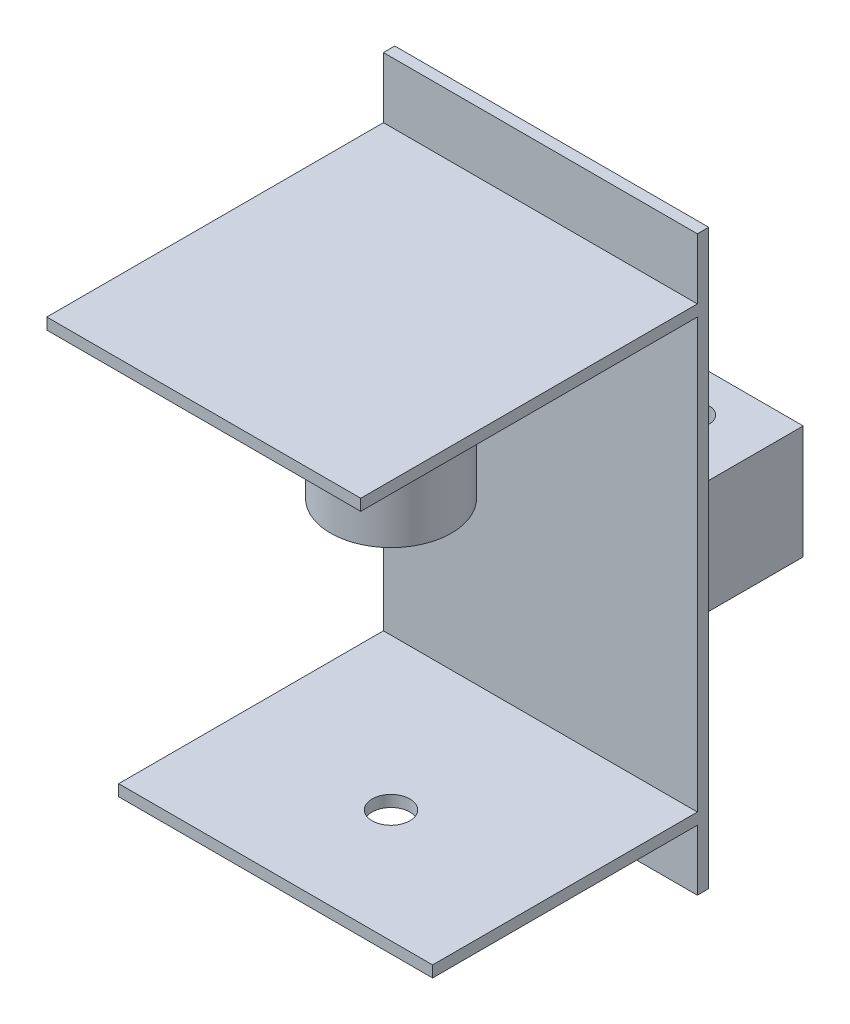
ISO-10303-21;
HEADER;
FILE_DESCRIPTION(('STEP AP214'),'2;1');
FILE_NAME('part.step','',(''),(''),'','','');
FILE_SCHEMA(('AUTOMOTIVE_DESIGN { 1 0 10303 214 1 1 1 1 }'));
ENDSEC;
DATA;
#1=APPLICATION_CONTEXT('core data for automotive mechanical design processes');
#2=APPLICATION_PROTOCOL_DEFINITION('international standard','automotive_design',2000,#1);
#3=PRODUCT_CONTEXT('',#1,'mechanical');
#4=PRODUCT('Part','Part','',(#3));
#5=PRODUCT_RELATED_PRODUCT_CATEGORY('part','',(#4));
#6=PRODUCT_DEFINITION_FORMATION('','',#4);
#7=PRODUCT_DEFINITION_CONTEXT('part definition',#1,'design');
#8=PRODUCT_DEFINITION('design','',#6,#7);
#9=PRODUCT_DEFINITION_SHAPE('','',#8);
#10=(LENGTH_UNIT() NAMED_UNIT(*) SI_UNIT(.MILLI.,.METRE.));
#11=(NAMED_UNIT(*) PLANE_ANGLE_UNIT() SI_UNIT($,.RADIAN.));
#12=(NAMED_UNIT(*) SI_UNIT($,.STERADIAN.) SOLID_ANGLE_UNIT());
#13=UNCERTAINTY_MEASURE_WITH_UNIT(LENGTH_MEASURE(1.E-05),#10,'distance_accuracy_value','');
#14=(GEOMETRIC_REPRESENTATION_CONTEXT(3) GLOBAL_UNCERTAINTY_ASSIGNED_CONTEXT((#13)) GLOBAL_UNIT_ASSIGNED_CONTEXT((#10,
#11,#12)) REPRESENTATION_CONTEXT('',''));
#15=CARTESIAN_POINT('',(0.,0.,0.));
#16=DIRECTION('',(0.,0.,1.));
#17=DIRECTION('',(1.,0.,0.));
#18=AXIS2_PLACEMENT_3D('',#15,#16,#17);
#19=CARTESIAN_POINT('',(0.,0.,0.));
#20=DIRECTION('',(0.,0.,-1.));
#21=DIRECTION('',(-1.,0.,0.));
#22=AXIS2_PLACEMENT_3D('',#19,#20,#21);
#23=PLANE('',#22);
#24=DIRECTION('',(1.,0.,0.));
#25=VECTOR('',#24,1.);
#26=CARTESIAN_POINT('',(4.979,88.45,0.));
#27=LINE('',#26,#25);
#28=CARTESIAN_POINT('',(4.979,88.45,0.));
#29=VERTEX_POINT('',#28);
#30=CARTESIAN_POINT('',(38.979,88.45,0.));
#31=VERTEX_POINT('',#30);
#32=EDGE_CURVE('E260',#29,#31,#27,.T.);
#33=ORIENTED_EDGE('',*,*,#32,.F.);
#34=DIRECTION('',(0.,1.,0.));
#35=VECTOR('',#34,1.);
#36=CARTESIAN_POINT('',(4.979,58.45,0.));
#37=LINE('',#36,#35);
#38=CARTESIAN_POINT('',(4.979,58.45,0.));
#39=VERTEX_POINT('',#38);
#40=EDGE_CURVE('E256',#39,#29,#37,.T.);
#41=ORIENTED_EDGE('',*,*,#40,.F.);
#42=DIRECTION('',(1.,0.,0.));
#43=VECTOR('',#42,1.);
#44=CARTESIAN_POINT('',(4.979,58.45,0.));
#45=LINE('',#44,#43);
#46=CARTESIAN_POINT('',(38.979,58.45,0.));
#47=VERTEX_POINT('',#46);
#48=EDGE_CURVE('E243',#39,#47,#45,.T.);
#49=ORIENTED_EDGE('',*,*,#48,.T.);
#50=DIRECTION('',(0.,1.,0.));
#51=VECTOR('',#50,1.);
#52=CARTESIAN_POINT('',(38.979,58.45,0.));
#53=LINE('',#52,#51);
#54=EDGE_CURVE('E277',#47,#31,#53,.T.);
#55=ORIENTED_EDGE('',*,*,#54,.T.);
#56=EDGE_LOOP('',(#33,#41,#49,#55));
#57=FACE_BOUND('',#56,.T.);
#58=DIRECTION('',(0.,-1.,0.));
#59=VECTOR('',#58,1.);
#60=CARTESIAN_POINT('',(0.,0.,0.));
#61=LINE('',#60,#59);
#62=CARTESIAN_POINT('',(0.,151.45,0.));
#63=VERTEX_POINT('',#62);
#64=CARTESIAN_POINT('',(0.,0.,0.));
#65=VERTEX_POINT('',#64);
#66=EDGE_CURVE('E354',#63,#65,#61,.T.);
#67=ORIENTED_EDGE('',*,*,#66,.F.);
#68=DIRECTION('',(-1.,0.,0.));
#69=VECTOR('',#68,1.);
#70=CARTESIAN_POINT('',(0.,151.45,0.));
#71=LINE('',#70,#69);
#72=CARTESIAN_POINT('',(83.,151.45,0.));
#73=VERTEX_POINT('',#72);
#74=EDGE_CURVE('E384',#73,#63,#71,.T.);
#75=ORIENTED_EDGE('',*,*,#74,.F.);
#76=DIRECTION('',(0.,1.,0.));
#77=VECTOR('',#76,1.);
#78=CARTESIAN_POINT('',(83.,0.,0.));
#79=LINE('',#78,#77);
#80=CARTESIAN_POINT('',(83.,0.,0.));
#81=VERTEX_POINT('',#80);
#82=EDGE_CURVE('E381',#81,#73,#79,.T.);
#83=ORIENTED_EDGE('',*,*,#82,.F.);
#84=DIRECTION('',(1.,0.,0.));
#85=VECTOR('',#84,1.);
#86=CARTESIAN_POINT('',(0.,0.,0.));
#87=LINE('',#86,#85);
#88=EDGE_CURVE('E378',#65,#81,#87,.T.);
#89=ORIENTED_EDGE('',*,*,#88,.F.);
#90=EDGE_LOOP('',(#67,#75,#83,#89));
#91=FACE_BOUND('',#90,.T.);
#92=DIRECTION('',(0.,1.,0.));
#93=VECTOR('',#92,1.);
#94=CARTESIAN_POINT('',(43.98,58.45,0.));
#95=LINE('',#94,#93);
#96=CARTESIAN_POINT('',(43.98,58.45,0.));
#97=VERTEX_POINT('',#96);
#98=CARTESIAN_POINT('',(43.98,88.45,0.));
#99=VERTEX_POINT('',#98);
#100=EDGE_CURVE('E62',#97,#99,#95,.T.);
#101=ORIENTED_EDGE('',*,*,#100,.F.);
#102=DIRECTION('',(1.,0.,0.));
#103=VECTOR('',#102,1.);
#104=CARTESIAN_POINT('',(43.98,58.45,0.));
#105=LINE('',#104,#103);
#106=CARTESIAN_POINT('',(77.98,58.45,0.));
#107=VERTEX_POINT('',#106);
#108=EDGE_CURVE('E66',#97,#107,#105,.T.);
#109=ORIENTED_EDGE('',*,*,#108,.T.);
#110=DIRECTION('',(0.,1.,0.));
#111=VECTOR('',#110,1.);
#112=CARTESIAN_POINT('',(77.98,58.45,0.));
#113=LINE('',#112,#111);
#114=CARTESIAN_POINT('',(77.98,88.45,0.));
#115=VERTEX_POINT('',#114);
#116=EDGE_CURVE('E194',#107,#115,#113,.T.);
#117=ORIENTED_EDGE('',*,*,#116,.T.);
#118=DIRECTION('',(1.,0.,0.));
#119=VECTOR('',#118,1.);
#120=CARTESIAN_POINT('',(43.98,88.45,0.));
#121=LINE('',#120,#119);
#122=EDGE_CURVE('E216',#99,#115,#121,.T.);
#123=ORIENTED_EDGE('',*,*,#122,.F.);
#124=EDGE_LOOP('',(#101,#109,#117,#123));
#125=FACE_BOUND('',#124,.T.);
#126=ADVANCED_FACE('F45',(#57,#91,#125),#23,.T.);
#127=CARTESIAN_POINT('',(0.,0.,3.));
#128=DIRECTION('',(0.,0.,-1.));
#129=DIRECTION('',(-1.,0.,0.));
#130=AXIS2_PLACEMENT_3D('',#127,#128,#129);
#131=PLANE('',#130);
#132=DIRECTION('',(1.,0.,0.));
#133=VECTOR('',#132,1.);
#134=CARTESIAN_POINT('',(0.,135.4,3.));
#135=LINE('',#134,#133);
#136=CARTESIAN_POINT('',(0.,135.4,3.));
#137=VERTEX_POINT('',#136);
#138=CARTESIAN_POINT('',(83.,135.4,3.));
#139=VERTEX_POINT('',#138);
#140=EDGE_CURVE('E304',#137,#139,#135,.T.);
#141=ORIENTED_EDGE('',*,*,#140,.T.);
#142=DIRECTION('',(0.,1.,0.));
#143=VECTOR('',#142,1.);
#144=CARTESIAN_POINT('',(83.,0.,3.));
#145=LINE('',#144,#143);
#146=CARTESIAN_POINT('',(83.,151.45,3.));
#147=VERTEX_POINT('',#146);
#148=EDGE_CURVE('E365',#139,#147,#145,.T.);
#149=ORIENTED_EDGE('',*,*,#148,.T.);
#150=DIRECTION('',(-1.,0.,0.));
#151=VECTOR('',#150,1.);
#152=CARTESIAN_POINT('',(0.,151.45,3.));
#153=LINE('',#152,#151);
#154=CARTESIAN_POINT('',(0.,151.45,3.));
#155=VERTEX_POINT('',#154);
#156=EDGE_CURVE('E370',#147,#155,#153,.T.);
#157=ORIENTED_EDGE('',*,*,#156,.T.);
#158=DIRECTION('',(0.,-1.,0.));
#159=VECTOR('',#158,1.);
#160=CARTESIAN_POINT('',(0.,0.,3.));
#161=LINE('',#160,#159);
#162=EDGE_CURVE('E357',#155,#137,#161,.T.);
#163=ORIENTED_EDGE('',*,*,#162,.T.);
#164=EDGE_LOOP('',(#141,#149,#157,#163));
#165=FACE_BOUND('',#164,.T.);
#166=ADVANCED_FACE('F423',(#165),#131,.F.);
#167=DIRECTION('',(1.,0.,0.));
#168=VECTOR('',#167,1.);
#169=CARTESIAN_POINT('',(0.,16.05,3.));
#170=LINE('',#169,#168);
#171=CARTESIAN_POINT('',(0.,16.05,3.));
#172=VERTEX_POINT('',#171);
#173=CARTESIAN_POINT('',(83.,16.05,3.));
#174=VERTEX_POINT('',#173);
#175=EDGE_CURVE('E340',#172,#174,#170,.T.);
#176=ORIENTED_EDGE('',*,*,#175,.F.);
#177=CARTESIAN_POINT('',(0.,0.,3.));
#178=VERTEX_POINT('',#177);
#179=EDGE_CURVE('E362',#172,#178,#161,.T.);
#180=ORIENTED_EDGE('',*,*,#179,.T.);
#181=DIRECTION('',(1.,0.,0.));
#182=VECTOR('',#181,1.);
#183=CARTESIAN_POINT('',(0.,0.,3.));
#184=LINE('',#183,#182);
#185=CARTESIAN_POINT('',(83.,0.,3.));
#186=VERTEX_POINT('',#185);
#187=EDGE_CURVE('E360',#178,#186,#184,.T.);
#188=ORIENTED_EDGE('',*,*,#187,.T.);
#189=EDGE_CURVE('E366',#186,#174,#145,.T.);
#190=ORIENTED_EDGE('',*,*,#189,.T.);
#191=EDGE_LOOP('',(#176,#180,#188,#190));
#192=FACE_BOUND('',#191,.T.);
#193=ADVANCED_FACE('F446',(#192),#131,.F.);
#194=CARTESIAN_POINT('',(0.,0.,3.));
#195=DIRECTION('',(1.,0.,0.));
#196=DIRECTION('',(0.,0.,-1.));
#197=AXIS2_PLACEMENT_3D('',#194,#195,#196);
#198=PLANE('',#197);
#199=DIRECTION('',(0.,0.,-1.));
#200=VECTOR('',#199,1.);
#201=CARTESIAN_POINT('',(0.,135.4,3.));
#202=LINE('',#201,#200);
#203=CARTESIAN_POINT('',(0.,135.4,92.));
#204=VERTEX_POINT('',#203);
#205=EDGE_CURVE('E295',#204,#137,#202,.T.);
#206=ORIENTED_EDGE('',*,*,#205,.T.);
#207=ORIENTED_EDGE('',*,*,#162,.F.);
#208=DIRECTION('',(0.,0.,-1.));
#209=VECTOR('',#208,1.);
#210=CARTESIAN_POINT('',(0.,151.45,3.));
#211=LINE('',#210,#209);
#212=EDGE_CURVE('E374',#155,#63,#211,.T.);
#213=ORIENTED_EDGE('',*,*,#212,.T.);
#214=ORIENTED_EDGE('',*,*,#66,.T.);
#215=DIRECTION('',(0.,0.,-1.));
#216=VECTOR('',#215,1.);
#217=CARTESIAN_POINT('',(0.,0.,3.));
#218=LINE('',#217,#216);
#219=EDGE_CURVE('E55',#178,#65,#218,.T.);
#220=ORIENTED_EDGE('',*,*,#219,.F.);
#221=ORIENTED_EDGE('',*,*,#179,.F.);
#222=DIRECTION('',(0.,0.,-1.));
#223=VECTOR('',#222,1.);
#224=CARTESIAN_POINT('',(0.,16.05,3.));
#225=LINE('',#224,#223);
#226=CARTESIAN_POINT('',(0.,16.05,73.));
#227=VERTEX_POINT('',#226);
#228=EDGE_CURVE('E311',#227,#172,#225,.T.);
#229=ORIENTED_EDGE('',*,*,#228,.F.);
#230=DIRECTION('',(0.,-1.,0.));
#231=VECTOR('',#230,1.);
#232=CARTESIAN_POINT('',(0.,19.05,73.));
#233=LINE('',#232,#231);
#234=CARTESIAN_POINT('',(0.,19.05,73.));
#235=VERTEX_POINT('',#234);
#236=EDGE_CURVE('E351',#235,#227,#233,.T.);
#237=ORIENTED_EDGE('',*,*,#236,.F.);
#238=DIRECTION('',(0.,0.,-1.));
#239=VECTOR('',#238,1.);
#240=CARTESIAN_POINT('',(0.,19.05,3.));
#241=LINE('',#240,#239);
#242=CARTESIAN_POINT('',(0.,19.05,3.));
#243=VERTEX_POINT('',#242);
#244=EDGE_CURVE('E320',#235,#243,#241,.T.);
#245=ORIENTED_EDGE('',*,*,#244,.T.);
#246=CARTESIAN_POINT('',(0.,132.4,3.));
#247=VERTEX_POINT('',#246);
#248=EDGE_CURVE('E361',#247,#243,#161,.T.);
#249=ORIENTED_EDGE('',*,*,#248,.F.);
#250=DIRECTION('',(0.,0.,-1.));
#251=VECTOR('',#250,1.);
#252=CARTESIAN_POINT('',(0.,132.4,3.));
#253=LINE('',#252,#251);
#254=CARTESIAN_POINT('',(0.,132.4,92.));
#255=VERTEX_POINT('',#254);
#256=EDGE_CURVE('E299',#255,#247,#253,.T.);
#257=ORIENTED_EDGE('',*,*,#256,.F.);
#258=DIRECTION('',(0.,1.,0.));
#259=VECTOR('',#258,1.);
#260=CARTESIAN_POINT('',(0.,132.4,92.));
#261=LINE('',#260,#259);
#262=EDGE_CURVE('E291',#255,#204,#261,.T.);
#263=ORIENTED_EDGE('',*,*,#262,.T.);
#264=EDGE_LOOP('',(#206,#207,#213,#214,#220,#221,#229,#237,#245,#249,#257,#263));
#265=FACE_BOUND('',#264,.T.);
#266=ADVANCED_FACE('F47',(#265),#198,.F.);
#267=CARTESIAN_POINT('',(0.,0.,3.));
#268=DIRECTION('',(0.,1.,0.));
#269=DIRECTION('',(0.,0.,1.));
#270=AXIS2_PLACEMENT_3D('',#267,#268,#269);
#271=PLANE('',#270);
#272=ORIENTED_EDGE('',*,*,#88,.T.);
#273=DIRECTION('',(0.,0.,-1.));
#274=VECTOR('',#273,1.);
#275=CARTESIAN_POINT('',(83.,0.,3.));
#276=LINE('',#275,#274);
#277=EDGE_CURVE('E394',#186,#81,#276,.T.);
#278=ORIENTED_EDGE('',*,*,#277,.F.);
#279=ORIENTED_EDGE('',*,*,#187,.F.);
#280=ORIENTED_EDGE('',*,*,#219,.T.);
#281=EDGE_LOOP('',(#272,#278,#279,#280));
#282=FACE_BOUND('',#281,.T.);
#283=ADVANCED_FACE('F403',(#282),#271,.F.);
#284=CARTESIAN_POINT('',(83.,0.,3.));
#285=DIRECTION('',(-1.,0.,0.));
#286=DIRECTION('',(0.,0.,1.));
#287=AXIS2_PLACEMENT_3D('',#284,#285,#286);
#288=PLANE('',#287);
#289=DIRECTION('',(0.,0.,1.));
#290=VECTOR('',#289,1.);
#291=CARTESIAN_POINT('',(83.,132.4,3.));
#292=LINE('',#291,#290);
#293=CARTESIAN_POINT('',(83.,132.4,3.));
#294=VERTEX_POINT('',#293);
#295=CARTESIAN_POINT('',(83.,132.4,92.));
#296=VERTEX_POINT('',#295);
#297=EDGE_CURVE('E303',#294,#296,#292,.T.);
#298=ORIENTED_EDGE('',*,*,#297,.F.);
#299=CARTESIAN_POINT('',(83.,19.05,3.));
#300=VERTEX_POINT('',#299);
#301=EDGE_CURVE('E371',#300,#294,#145,.T.);
#302=ORIENTED_EDGE('',*,*,#301,.F.);
#303=DIRECTION('',(0.,0.,1.));
#304=VECTOR('',#303,1.);
#305=CARTESIAN_POINT('',(83.,19.05,3.));
#306=LINE('',#305,#304);
#307=CARTESIAN_POINT('',(83.,19.05,73.));
#308=VERTEX_POINT('',#307);
#309=EDGE_CURVE('E329',#300,#308,#306,.T.);
#310=ORIENTED_EDGE('',*,*,#309,.T.);
#311=DIRECTION('',(0.,-1.,0.));
#312=VECTOR('',#311,1.);
#313=CARTESIAN_POINT('',(83.,19.05,73.));
#314=LINE('',#313,#312);
#315=CARTESIAN_POINT('',(83.,16.05,73.));
#316=VERTEX_POINT('',#315);
#317=EDGE_CURVE('E337',#308,#316,#314,.T.);
#318=ORIENTED_EDGE('',*,*,#317,.T.);
#319=DIRECTION('',(0.,0.,1.));
#320=VECTOR('',#319,1.);
#321=CARTESIAN_POINT('',(83.,16.05,3.));
#322=LINE('',#321,#320);
#323=EDGE_CURVE('E344',#174,#316,#322,.T.);
#324=ORIENTED_EDGE('',*,*,#323,.F.);
#325=ORIENTED_EDGE('',*,*,#189,.F.);
#326=ORIENTED_EDGE('',*,*,#277,.T.);
#327=ORIENTED_EDGE('',*,*,#82,.T.);
#328=DIRECTION('',(0.,0.,-1.));
#329=VECTOR('',#328,1.);
#330=CARTESIAN_POINT('',(83.,151.45,3.));
#331=LINE('',#330,#329);
#332=EDGE_CURVE('E390',#147,#73,#331,.T.);
#333=ORIENTED_EDGE('',*,*,#332,.F.);
#334=ORIENTED_EDGE('',*,*,#148,.F.);
#335=DIRECTION('',(0.,0.,1.));
#336=VECTOR('',#335,1.);
#337=CARTESIAN_POINT('',(83.,135.4,3.));
#338=LINE('',#337,#336);
#339=CARTESIAN_POINT('',(83.,135.4,92.));
#340=VERTEX_POINT('',#339);
#341=EDGE_CURVE('E315',#139,#340,#338,.T.);
#342=ORIENTED_EDGE('',*,*,#341,.T.);
#343=DIRECTION('',(0.,1.,0.));
#344=VECTOR('',#343,1.);
#345=CARTESIAN_POINT('',(83.,132.4,92.));
#346=LINE('',#345,#344);
#347=EDGE_CURVE('E287',#296,#340,#346,.T.);
#348=ORIENTED_EDGE('',*,*,#347,.F.);
#349=EDGE_LOOP('',(#298,#302,#310,#318,#324,#325,#326,#327,#333,#334,#342,#348));
#350=FACE_BOUND('',#349,.T.);
#351=ADVANCED_FACE('F416',(#350),#288,.F.);
#352=CARTESIAN_POINT('',(0.,151.45,3.));
#353=DIRECTION('',(0.,-1.,0.));
#354=DIRECTION('',(0.,0.,-1.));
#355=AXIS2_PLACEMENT_3D('',#352,#353,#354);
#356=PLANE('',#355);
#357=ORIENTED_EDGE('',*,*,#74,.T.);
#358=ORIENTED_EDGE('',*,*,#212,.F.);
#359=ORIENTED_EDGE('',*,*,#156,.F.);
#360=ORIENTED_EDGE('',*,*,#332,.T.);
#361=EDGE_LOOP('',(#357,#358,#359,#360));
#362=FACE_BOUND('',#361,.T.);
#363=ADVANCED_FACE('F421',(#362),#356,.F.);
#364=ORIENTED_EDGE('',*,*,#301,.T.);
#365=DIRECTION('',(1.,0.,0.));
#366=VECTOR('',#365,1.);
#367=CARTESIAN_POINT('',(0.,132.4,3.));
#368=LINE('',#367,#366);
#369=EDGE_CURVE('E307',#247,#294,#368,.T.);
#370=ORIENTED_EDGE('',*,*,#369,.F.);
#371=ORIENTED_EDGE('',*,*,#248,.T.);
#372=DIRECTION('',(1.,0.,0.));
#373=VECTOR('',#372,1.);
#374=CARTESIAN_POINT('',(0.,19.05,3.));
#375=LINE('',#374,#373);
#376=EDGE_CURVE('E324',#243,#300,#375,.T.);
#377=ORIENTED_EDGE('',*,*,#376,.T.);
#378=EDGE_LOOP('',(#364,#370,#371,#377));
#379=FACE_BOUND('',#378,.T.);
#380=ADVANCED_FACE('F430',(#379),#131,.F.);
#381=CARTESIAN_POINT('',(0.,19.05,73.));
#382=DIRECTION('',(0.,0.,1.));
#383=DIRECTION('',(1.,0.,0.));
#384=AXIS2_PLACEMENT_3D('',#381,#382,#383);
#385=PLANE('',#384);
#386=DIRECTION('',(-1.,0.,0.));
#387=VECTOR('',#386,1.);
#388=CARTESIAN_POINT('',(0.,16.05,73.));
#389=LINE('',#388,#387);
#390=EDGE_CURVE('E325',#316,#227,#389,.T.);
#391=ORIENTED_EDGE('',*,*,#390,.F.);
#392=ORIENTED_EDGE('',*,*,#317,.F.);
#393=DIRECTION('',(-1.,0.,0.));
#394=VECTOR('',#393,1.);
#395=CARTESIAN_POINT('',(0.,19.05,73.));
#396=LINE('',#395,#394);
#397=EDGE_CURVE('E333',#308,#235,#396,.T.);
#398=ORIENTED_EDGE('',*,*,#397,.T.);
#399=ORIENTED_EDGE('',*,*,#236,.T.);
#400=EDGE_LOOP('',(#391,#392,#398,#399));
#401=FACE_BOUND('',#400,.T.);
#402=ADVANCED_FACE('F452',(#401),#385,.T.);
#403=CARTESIAN_POINT('',(0.,19.05,0.));
#404=DIRECTION('',(0.,1.,0.));
#405=DIRECTION('',(0.,0.,1.));
#406=AXIS2_PLACEMENT_3D('',#403,#404,#405);
#407=PLANE('',#406);
#408=CARTESIAN_POINT('',(42.,19.05,43.));
#409=DIRECTION('',(0.,1.,0.));
#410=DIRECTION('',(0.,0.,1.));
#411=AXIS2_PLACEMENT_3D('',#408,#409,#410);
#412=CIRCLE('',#411,5.);
#413=CARTESIAN_POINT('',(42.,19.05,48.));
#414=VERTEX_POINT('',#413);
#415=EDGE_CURVE('E746',#414,#414,#412,.T.);
#416=ORIENTED_EDGE('',*,*,#415,.F.);
#417=EDGE_LOOP('',(#416));
#418=FACE_BOUND('',#417,.T.);
#419=ORIENTED_EDGE('',*,*,#244,.F.);
#420=ORIENTED_EDGE('',*,*,#397,.F.);
#421=ORIENTED_EDGE('',*,*,#309,.F.);
#422=ORIENTED_EDGE('',*,*,#376,.F.);
#423=EDGE_LOOP('',(#419,#420,#421,#422));
#424=FACE_BOUND('',#423,.T.);
#425=ADVANCED_FACE('F455',(#418,#424),#407,.T.);
#426=CARTESIAN_POINT('',(0.,16.05,0.));
#427=DIRECTION('',(0.,1.,0.));
#428=DIRECTION('',(0.,0.,1.));
#429=AXIS2_PLACEMENT_3D('',#426,#427,#428);
#430=PLANE('',#429);
#431=CARTESIAN_POINT('',(42.,16.05,43.));
#432=DIRECTION('',(0.,1.,0.));
#433=DIRECTION('',(0.,0.,1.));
#434=AXIS2_PLACEMENT_3D('',#431,#432,#433);
#435=CIRCLE('',#434,5.);
#436=CARTESIAN_POINT('',(42.,16.05,48.));
#437=VERTEX_POINT('',#436);
#438=EDGE_CURVE('E49',#437,#437,#435,.T.);
#439=ORIENTED_EDGE('',*,*,#438,.T.);
#440=EDGE_LOOP('',(#439));
#441=FACE_BOUND('',#440,.T.);
#442=ORIENTED_EDGE('',*,*,#228,.T.);
#443=ORIENTED_EDGE('',*,*,#175,.T.);
#444=ORIENTED_EDGE('',*,*,#323,.T.);
#445=ORIENTED_EDGE('',*,*,#390,.T.);
#446=EDGE_LOOP('',(#442,#443,#444,#445));
#447=FACE_BOUND('',#446,.T.);
#448=ADVANCED_FACE('F450',(#441,#447),#430,.F.);
#449=CARTESIAN_POINT('',(0.,132.4,0.));
#450=DIRECTION('',(0.,-1.,0.));
#451=DIRECTION('',(0.,0.,1.));
#452=AXIS2_PLACEMENT_3D('',#449,#450,#451);
#453=PLANE('',#452);
#454=CARTESIAN_POINT('',(42.,132.4,43.));
#455=DIRECTION('',(0.,-1.,0.));
#456=DIRECTION('',(0.,0.,-1.));
#457=AXIS2_PLACEMENT_3D('',#454,#455,#456);
#458=CIRCLE('',#457,16.);
#459=CARTESIAN_POINT('',(42.,132.4,27.));
#460=VERTEX_POINT('',#459);
#461=EDGE_CURVE('E754',#460,#460,#458,.T.);
#462=ORIENTED_EDGE('',*,*,#461,.F.);
#463=EDGE_LOOP('',(#462));
#464=FACE_BOUND('',#463,.T.);
#465=ORIENTED_EDGE('',*,*,#256,.T.);
#466=ORIENTED_EDGE('',*,*,#369,.T.);
#467=ORIENTED_EDGE('',*,*,#297,.T.);
#468=DIRECTION('',(1.,0.,0.));
#469=VECTOR('',#468,1.);
#470=CARTESIAN_POINT('',(0.,132.4,92.));
#471=LINE('',#470,#469);
#472=EDGE_CURVE('E283',#255,#296,#471,.T.);
#473=ORIENTED_EDGE('',*,*,#472,.F.);
#474=EDGE_LOOP('',(#465,#466,#467,#473));
#475=FACE_BOUND('',#474,.T.);
#476=ADVANCED_FACE('F434',(#464,#475),#453,.T.);
#477=CARTESIAN_POINT('',(0.,135.4,0.));
#478=DIRECTION('',(0.,-1.,0.));
#479=DIRECTION('',(0.,0.,1.));
#480=AXIS2_PLACEMENT_3D('',#477,#478,#479);
#481=PLANE('',#480);
#482=ORIENTED_EDGE('',*,*,#205,.F.);
#483=DIRECTION('',(1.,0.,0.));
#484=VECTOR('',#483,1.);
#485=CARTESIAN_POINT('',(0.,135.4,92.));
#486=LINE('',#485,#484);
#487=EDGE_CURVE('E273',#204,#340,#486,.T.);
#488=ORIENTED_EDGE('',*,*,#487,.T.);
#489=ORIENTED_EDGE('',*,*,#341,.F.);
#490=ORIENTED_EDGE('',*,*,#140,.F.);
#491=EDGE_LOOP('',(#482,#488,#489,#490));
#492=FACE_BOUND('',#491,.T.);
#493=ADVANCED_FACE('F542',(#492),#481,.F.);
#494=CARTESIAN_POINT('',(0.,132.4,92.));
#495=DIRECTION('',(0.,0.,1.));
#496=DIRECTION('',(1.,0.,0.));
#497=AXIS2_PLACEMENT_3D('',#494,#495,#496);
#498=PLANE('',#497);
#499=ORIENTED_EDGE('',*,*,#487,.F.);
#500=ORIENTED_EDGE('',*,*,#262,.F.);
#501=ORIENTED_EDGE('',*,*,#472,.T.);
#502=ORIENTED_EDGE('',*,*,#347,.T.);
#503=EDGE_LOOP('',(#499,#500,#501,#502));
#504=FACE_BOUND('',#503,.T.);
#505=ADVANCED_FACE('F440',(#504),#498,.T.);
#506=CARTESIAN_POINT('',(4.979,58.45,-28.));
#507=DIRECTION('',(-1.,0.,0.));
#508=DIRECTION('',(0.,0.,1.));
#509=AXIS2_PLACEMENT_3D('',#506,#507,#508);
#510=PLANE('',#509);
#511=DIRECTION('',(0.,0.,1.));
#512=VECTOR('',#511,1.);
#513=CARTESIAN_POINT('',(4.979,88.45,-28.));
#514=LINE('',#513,#512);
#515=CARTESIAN_POINT('',(4.979,88.45,-28.));
#516=VERTEX_POINT('',#515);
#517=EDGE_CURVE('E235',#516,#29,#514,.T.);
#518=ORIENTED_EDGE('',*,*,#517,.F.);
#519=DIRECTION('',(0.,1.,0.));
#520=VECTOR('',#519,1.);
#521=CARTESIAN_POINT('',(4.979,58.45,-28.));
#522=LINE('',#521,#520);
#523=CARTESIAN_POINT('',(4.979,58.45,-28.));
#524=VERTEX_POINT('',#523);
#525=EDGE_CURVE('E270',#524,#516,#522,.T.);
#526=ORIENTED_EDGE('',*,*,#525,.F.);
#527=DIRECTION('',(0.,0.,1.));
#528=VECTOR('',#527,1.);
#529=CARTESIAN_POINT('',(4.979,58.45,-28.));
#530=LINE('',#529,#528);
#531=EDGE_CURVE('E239',#524,#39,#530,.T.);
#532=ORIENTED_EDGE('',*,*,#531,.T.);
#533=ORIENTED_EDGE('',*,*,#40,.T.);
#534=EDGE_LOOP('',(#518,#526,#532,#533));
#535=FACE_BOUND('',#534,.T.);
#536=ADVANCED_FACE('F564',(#535),#510,.T.);
#537=CARTESIAN_POINT('',(4.979,58.45,-28.));
#538=DIRECTION('',(0.,0.,-1.));
#539=DIRECTION('',(-1.,0.,0.));
#540=AXIS2_PLACEMENT_3D('',#537,#538,#539);
#541=PLANE('',#540);
#542=DIRECTION('',(-1.,0.,0.));
#543=VECTOR('',#542,1.);
#544=CARTESIAN_POINT('',(4.979,88.45,-28.));
#545=LINE('',#544,#543);
#546=CARTESIAN_POINT('',(38.979,88.45,-28.));
#547=VERTEX_POINT('',#546);
#548=EDGE_CURVE('E244',#547,#516,#545,.T.);
#549=ORIENTED_EDGE('',*,*,#548,.F.);
#550=DIRECTION('',(0.,1.,0.));
#551=VECTOR('',#550,1.);
#552=CARTESIAN_POINT('',(38.979,58.45,-28.));
#553=LINE('',#552,#551);
#554=CARTESIAN_POINT('',(38.979,58.45,-28.));
#555=VERTEX_POINT('',#554);
#556=EDGE_CURVE('E274',#555,#547,#553,.T.);
#557=ORIENTED_EDGE('',*,*,#556,.F.);
#558=DIRECTION('',(-1.,0.,0.));
#559=VECTOR('',#558,1.);
#560=CARTESIAN_POINT('',(4.979,58.45,-28.));
#561=LINE('',#560,#559);
#562=EDGE_CURVE('E252',#555,#524,#561,.T.);
#563=ORIENTED_EDGE('',*,*,#562,.T.);
#564=ORIENTED_EDGE('',*,*,#525,.T.);
#565=EDGE_LOOP('',(#549,#557,#563,#564));
#566=FACE_BOUND('',#565,.T.);
#567=ADVANCED_FACE('F576',(#566),#541,.T.);
#568=CARTESIAN_POINT('',(38.979,58.45,-28.));
#569=DIRECTION('',(1.,0.,0.));
#570=DIRECTION('',(0.,0.,-1.));
#571=AXIS2_PLACEMENT_3D('',#568,#569,#570);
#572=PLANE('',#571);
#573=DIRECTION('',(0.,0.,-1.));
#574=VECTOR('',#573,1.);
#575=CARTESIAN_POINT('',(38.979,88.45,-28.));
#576=LINE('',#575,#574);
#577=EDGE_CURVE('E263',#31,#547,#576,.T.);
#578=ORIENTED_EDGE('',*,*,#577,.F.);
#579=ORIENTED_EDGE('',*,*,#54,.F.);
#580=DIRECTION('',(0.,0.,-1.));
#581=VECTOR('',#580,1.);
#582=CARTESIAN_POINT('',(38.979,58.45,-28.));
#583=LINE('',#582,#581);
#584=EDGE_CURVE('E248',#47,#555,#583,.T.);
#585=ORIENTED_EDGE('',*,*,#584,.T.);
#586=ORIENTED_EDGE('',*,*,#556,.T.);
#587=EDGE_LOOP('',(#578,#579,#585,#586));
#588=FACE_BOUND('',#587,.T.);
#589=ADVANCED_FACE('F585',(#588),#572,.T.);
#590=CARTESIAN_POINT('',(0.,58.45,0.));
#591=DIRECTION('',(0.,1.,0.));
#592=DIRECTION('',(0.,0.,1.));
#593=AXIS2_PLACEMENT_3D('',#590,#591,#592);
#594=PLANE('',#593);
#595=CARTESIAN_POINT('',(21.979,58.45,-18.));
#596=DIRECTION('',(0.,1.,0.));
#597=DIRECTION('',(0.,0.,1.));
#598=AXIS2_PLACEMENT_3D('',#595,#596,#597);
#599=CIRCLE('',#598,4.15);
#600=CARTESIAN_POINT('',(21.979,58.45,-13.85));
#601=VERTEX_POINT('',#600);
#602=EDGE_CURVE('E231',#601,#601,#599,.T.);
#603=ORIENTED_EDGE('',*,*,#602,.T.);
#604=EDGE_LOOP('',(#603));
#605=FACE_BOUND('',#604,.T.);
#606=ORIENTED_EDGE('',*,*,#531,.F.);
#607=ORIENTED_EDGE('',*,*,#562,.F.);
#608=ORIENTED_EDGE('',*,*,#584,.F.);
#609=ORIENTED_EDGE('',*,*,#48,.F.);
#610=EDGE_LOOP('',(#606,#607,#608,#609));
#611=FACE_BOUND('',#610,.T.);
#612=ADVANCED_FACE('F594',(#605,#611),#594,.F.);
#613=CARTESIAN_POINT('',(0.,88.45,0.));
#614=DIRECTION('',(0.,1.,0.));
#615=DIRECTION('',(0.,0.,1.));
#616=AXIS2_PLACEMENT_3D('',#613,#614,#615);
#617=PLANE('',#616);
#618=CARTESIAN_POINT('',(21.979,88.45,-18.));
#619=DIRECTION('',(0.,1.,0.));
#620=DIRECTION('',(0.,0.,1.));
#621=AXIS2_PLACEMENT_3D('',#618,#619,#620);
#622=CIRCLE('',#621,4.15);
#623=CARTESIAN_POINT('',(21.979,88.45,-13.85));
#624=VERTEX_POINT('',#623);
#625=EDGE_CURVE('E227',#624,#624,#622,.T.);
#626=ORIENTED_EDGE('',*,*,#625,.F.);
#627=EDGE_LOOP('',(#626));
#628=FACE_BOUND('',#627,.T.);
#629=ORIENTED_EDGE('',*,*,#517,.T.);
#630=ORIENTED_EDGE('',*,*,#32,.T.);
#631=ORIENTED_EDGE('',*,*,#577,.T.);
#632=ORIENTED_EDGE('',*,*,#548,.T.);
#633=EDGE_LOOP('',(#629,#630,#631,#632));
#634=FACE_BOUND('',#633,.T.);
#635=ADVANCED_FACE('F603',(#628,#634),#617,.T.);
#636=CARTESIAN_POINT('',(21.979,58.45,-18.));
#637=DIRECTION('',(0.,1.,0.));
#638=DIRECTION('',(0.,0.,1.));
#639=AXIS2_PLACEMENT_3D('',#636,#637,#638);
#640=CYLINDRICAL_SURFACE('',#639,4.15);
#641=ORIENTED_EDGE('',*,*,#602,.F.);
#642=EDGE_LOOP('',(#641));
#643=FACE_BOUND('',#642,.T.);
#644=ORIENTED_EDGE('',*,*,#625,.T.);
#645=EDGE_LOOP('',(#644));
#646=FACE_BOUND('',#645,.T.);
#647=ADVANCED_FACE('F612',(#643,#646),#640,.F.);
#648=CARTESIAN_POINT('',(43.98,58.45,-30.));
#649=DIRECTION('',(-1.,0.,0.));
#650=DIRECTION('',(0.,0.,1.));
#651=AXIS2_PLACEMENT_3D('',#648,#649,#650);
#652=PLANE('',#651);
#653=DIRECTION('',(0.,0.,1.));
#654=VECTOR('',#653,1.);
#655=CARTESIAN_POINT('',(43.98,88.45,-30.));
#656=LINE('',#655,#654);
#657=CARTESIAN_POINT('',(43.98,88.45,-30.));
#658=VERTEX_POINT('',#657);
#659=EDGE_CURVE('E212',#658,#99,#656,.T.);
#660=ORIENTED_EDGE('',*,*,#659,.F.);
#661=DIRECTION('',(0.,1.,0.));
#662=VECTOR('',#661,1.);
#663=CARTESIAN_POINT('',(43.98,58.45,-30.));
#664=LINE('',#663,#662);
#665=CARTESIAN_POINT('',(43.98,58.45,-30.));
#666=VERTEX_POINT('',#665);
#667=EDGE_CURVE('E193',#666,#658,#664,.T.);
#668=ORIENTED_EDGE('',*,*,#667,.F.);
#669=DIRECTION('',(0.,0.,1.));
#670=VECTOR('',#669,1.);
#671=CARTESIAN_POINT('',(43.98,58.45,-30.));
#672=LINE('',#671,#670);
#673=EDGE_CURVE('E205',#666,#97,#672,.T.);
#674=ORIENTED_EDGE('',*,*,#673,.T.);
#675=ORIENTED_EDGE('',*,*,#100,.T.);
#676=EDGE_LOOP('',(#660,#668,#674,#675));
#677=FACE_BOUND('',#676,.T.);
#678=ADVANCED_FACE('F621',(#677),#652,.T.);
#679=CARTESIAN_POINT('',(43.98,58.45,-30.));
#680=DIRECTION('',(0.,0.,-1.));
#681=DIRECTION('',(-1.,0.,0.));
#682=AXIS2_PLACEMENT_3D('',#679,#680,#681);
#683=PLANE('',#682);
#684=DIRECTION('',(-1.,0.,0.));
#685=VECTOR('',#684,1.);
#686=CARTESIAN_POINT('',(43.98,88.45,-30.));
#687=LINE('',#686,#685);
#688=CARTESIAN_POINT('',(77.98,88.45,-30.));
#689=VERTEX_POINT('',#688);
#690=EDGE_CURVE('E188',#689,#658,#687,.T.);
#691=ORIENTED_EDGE('',*,*,#690,.F.);
#692=DIRECTION('',(0.,1.,0.));
#693=VECTOR('',#692,1.);
#694=CARTESIAN_POINT('',(77.98,58.45,-30.));
#695=LINE('',#694,#693);
#696=CARTESIAN_POINT('',(77.98,58.45,-30.));
#697=VERTEX_POINT('',#696);
#698=EDGE_CURVE('E182',#697,#689,#695,.T.);
#699=ORIENTED_EDGE('',*,*,#698,.F.);
#700=DIRECTION('',(-1.,0.,0.));
#701=VECTOR('',#700,1.);
#702=CARTESIAN_POINT('',(43.98,58.45,-30.));
#703=LINE('',#702,#701);
#704=EDGE_CURVE('E186',#697,#666,#703,.T.);
#705=ORIENTED_EDGE('',*,*,#704,.T.);
#706=ORIENTED_EDGE('',*,*,#667,.T.);
#707=EDGE_LOOP('',(#691,#699,#705,#706));
#708=FACE_BOUND('',#707,.T.);
#709=ADVANCED_FACE('F184',(#708),#683,.T.);
#710=CARTESIAN_POINT('',(77.98,58.45,-30.));
#711=DIRECTION('',(1.,0.,0.));
#712=DIRECTION('',(0.,0.,-1.));
#713=AXIS2_PLACEMENT_3D('',#710,#711,#712);
#714=PLANE('',#713);
#715=DIRECTION('',(0.,0.,-1.));
#716=VECTOR('',#715,1.);
#717=CARTESIAN_POINT('',(77.98,88.45,-30.));
#718=LINE('',#717,#716);
#719=EDGE_CURVE('E221',#115,#689,#718,.T.);
#720=ORIENTED_EDGE('',*,*,#719,.F.);
#721=ORIENTED_EDGE('',*,*,#116,.F.);
#722=DIRECTION('',(0.,0.,-1.));
#723=VECTOR('',#722,1.);
#724=CARTESIAN_POINT('',(77.98,58.45,-30.));
#725=LINE('',#724,#723);
#726=EDGE_CURVE('E197',#107,#697,#725,.T.);
#727=ORIENTED_EDGE('',*,*,#726,.T.);
#728=ORIENTED_EDGE('',*,*,#698,.T.);
#729=EDGE_LOOP('',(#720,#721,#727,#728));
#730=FACE_BOUND('',#729,.T.);
#731=ADVANCED_FACE('F198',(#730),#714,.T.);
#732=CARTESIAN_POINT('',(0.,58.45,0.));
#733=DIRECTION('',(0.,1.,0.));
#734=DIRECTION('',(0.,0.,1.));
#735=AXIS2_PLACEMENT_3D('',#732,#733,#734);
#736=PLANE('',#735);
#737=CARTESIAN_POINT('',(60.98,58.45,-18.));
#738=DIRECTION('',(0.,1.,0.));
#739=DIRECTION('',(0.,0.,1.));
#740=AXIS2_PLACEMENT_3D('',#737,#738,#739);
#741=CIRCLE('',#740,4.15);
#742=CARTESIAN_POINT('',(60.98,58.45,-13.85));
#743=VERTEX_POINT('',#742);
#744=EDGE_CURVE('E217',#743,#743,#741,.T.);
#745=ORIENTED_EDGE('',*,*,#744,.T.);
#746=EDGE_LOOP('',(#745));
#747=FACE_BOUND('',#746,.T.);
#748=ORIENTED_EDGE('',*,*,#673,.F.);
#749=ORIENTED_EDGE('',*,*,#704,.F.);
#750=ORIENTED_EDGE('',*,*,#726,.F.);
#751=ORIENTED_EDGE('',*,*,#108,.F.);
#752=EDGE_LOOP('',(#748,#749,#750,#751));
#753=FACE_BOUND('',#752,.T.);
#754=ADVANCED_FACE('F203',(#747,#753),#736,.F.);
#755=CARTESIAN_POINT('',(0.,88.45,0.));
#756=DIRECTION('',(0.,1.,0.));
#757=DIRECTION('',(0.,0.,1.));
#758=AXIS2_PLACEMENT_3D('',#755,#756,#757);
#759=PLANE('',#758);
#760=CARTESIAN_POINT('',(60.98,88.45,-18.));
#761=DIRECTION('',(0.,1.,0.));
#762=DIRECTION('',(0.,0.,1.));
#763=AXIS2_PLACEMENT_3D('',#760,#761,#762);
#764=CIRCLE('',#763,4.15);
#765=CARTESIAN_POINT('',(60.98,88.45,-13.85));
#766=VERTEX_POINT('',#765);
#767=EDGE_CURVE('E762',#766,#766,#764,.T.);
#768=ORIENTED_EDGE('',*,*,#767,.F.);
#769=EDGE_LOOP('',(#768));
#770=FACE_BOUND('',#769,.T.);
#771=ORIENTED_EDGE('',*,*,#659,.T.);
#772=ORIENTED_EDGE('',*,*,#122,.T.);
#773=ORIENTED_EDGE('',*,*,#719,.T.);
#774=ORIENTED_EDGE('',*,*,#690,.T.);
#775=EDGE_LOOP('',(#771,#772,#773,#774));
#776=FACE_BOUND('',#775,.T.);
#777=ADVANCED_FACE('F652',(#770,#776),#759,.T.);
#778=CARTESIAN_POINT('',(60.98,58.45,-18.));
#779=DIRECTION('',(0.,1.,0.));
#780=DIRECTION('',(0.,0.,1.));
#781=AXIS2_PLACEMENT_3D('',#778,#779,#780);
#782=CYLINDRICAL_SURFACE('',#781,4.15);
#783=ORIENTED_EDGE('',*,*,#744,.F.);
#784=EDGE_LOOP('',(#783));
#785=FACE_BOUND('',#784,.T.);
#786=ORIENTED_EDGE('',*,*,#767,.T.);
#787=EDGE_LOOP('',(#786));
#788=FACE_BOUND('',#787,.T.);
#789=ADVANCED_FACE('F661',(#785,#788),#782,.F.);
#790=CARTESIAN_POINT('',(42.,90.4,43.));
#791=DIRECTION('',(0.,-1.,0.));
#792=DIRECTION('',(0.,0.,-1.));
#793=AXIS2_PLACEMENT_3D('',#790,#791,#792);
#794=PLANE('',#793);
#795=CARTESIAN_POINT('',(42.,90.4,43.));
#796=DIRECTION('',(0.,-1.,0.));
#797=DIRECTION('',(0.,0.,-1.));
#798=AXIS2_PLACEMENT_3D('',#795,#796,#797);
#799=CIRCLE('',#798,16.);
#800=CARTESIAN_POINT('',(42.,90.4,27.));
#801=VERTEX_POINT('',#800);
#802=EDGE_CURVE('E758',#801,#801,#799,.T.);
#803=ORIENTED_EDGE('',*,*,#802,.T.);
#804=EDGE_LOOP('',(#803));
#805=FACE_BOUND('',#804,.T.);
#806=CARTESIAN_POINT('',(42.,90.4,43.));
#807=DIRECTION('',(0.,-1.,0.));
#808=DIRECTION('',(0.,0.,-1.));
#809=AXIS2_PLACEMENT_3D('',#806,#807,#808);
#810=CIRCLE('',#809,15.);
#811=CARTESIAN_POINT('',(42.,90.4,28.));
#812=VERTEX_POINT('',#811);
#813=EDGE_CURVE('E750',#812,#812,#810,.T.);
#814=ORIENTED_EDGE('',*,*,#813,.F.);
#815=EDGE_LOOP('',(#814));
#816=FACE_BOUND('',#815,.T.);
#817=ADVANCED_FACE('F670',(#805,#816),#794,.T.);
#818=CARTESIAN_POINT('',(42.,90.4,43.));
#819=DIRECTION('',(0.,1.,0.));
#820=DIRECTION('',(0.,0.,1.));
#821=AXIS2_PLACEMENT_3D('',#818,#819,#820);
#822=CYLINDRICAL_SURFACE('',#821,16.);
#823=ORIENTED_EDGE('',*,*,#802,.F.);
#824=EDGE_LOOP('',(#823));
#825=FACE_BOUND('',#824,.T.);
#826=ORIENTED_EDGE('',*,*,#461,.T.);
#827=EDGE_LOOP('',(#826));
#828=FACE_BOUND('',#827,.T.);
#829=ADVANCED_FACE('F692',(#825,#828),#822,.T.);
#830=CARTESIAN_POINT('',(42.,90.4,43.));
#831=DIRECTION('',(0.,1.,0.));
#832=DIRECTION('',(0.,0.,1.));
#833=AXIS2_PLACEMENT_3D('',#830,#831,#832);
#834=CYLINDRICAL_SURFACE('',#833,15.);
#835=ORIENTED_EDGE('',*,*,#813,.T.);
#836=EDGE_LOOP('',(#835));
#837=FACE_BOUND('',#836,.T.);
#838=CARTESIAN_POINT('',(42.,132.4,43.));
#839=DIRECTION('',(0.,-1.,0.));
#840=DIRECTION('',(0.,0.,-1.));
#841=AXIS2_PLACEMENT_3D('',#838,#839,#840);
#842=CIRCLE('',#841,15.);
#843=CARTESIAN_POINT('',(42.,132.4,28.));
#844=VERTEX_POINT('',#843);
#845=EDGE_CURVE('E12',#844,#844,#842,.F.);
#846=ORIENTED_EDGE('',*,*,#845,.T.);
#847=EDGE_LOOP('',(#846));
#848=FACE_BOUND('',#847,.T.);
#849=ADVANCED_FACE('F679',(#837,#848),#834,.F.);
#850=ORIENTED_EDGE('',*,*,#845,.F.);
#851=EDGE_LOOP('',(#850));
#852=FACE_BOUND('',#851,.T.);
#853=ADVANCED_FACE('F545',(#852),#453,.T.);
#854=CARTESIAN_POINT('',(42.,0.,43.));
#855=DIRECTION('',(0.,1.,0.));
#856=DIRECTION('',(0.,0.,1.));
#857=AXIS2_PLACEMENT_3D('',#854,#855,#856);
#858=CYLINDRICAL_SURFACE('',#857,5.);
#859=ORIENTED_EDGE('',*,*,#415,.T.);
#860=EDGE_LOOP('',(#859));
#861=FACE_BOUND('',#860,.T.);
#862=ORIENTED_EDGE('',*,*,#438,.F.);
#863=EDGE_LOOP('',(#862));
#864=FACE_BOUND('',#863,.T.);
#865=ADVANCED_FACE('F678',(#861,#864),#858,.F.);
#866=CLOSED_SHELL('',(#126,#166,#193,#266,#283,#351,#363,#380,#402,#425,#448,#476,#493,#505,
#536,#567,#589,#612,#635,#647,#678,#709,#731,#754,#777,#789,#817,#829,#849,#853,#865));
#867=MANIFOLD_SOLID_BREP('B2',#866);
#868=ADVANCED_BREP_SHAPE_REPRESENTATION('',(#18,#867),#14);
#869=SHAPE_DEFINITION_REPRESENTATION(#9,#868);
ENDSEC;
END-ISO-10303-21;
